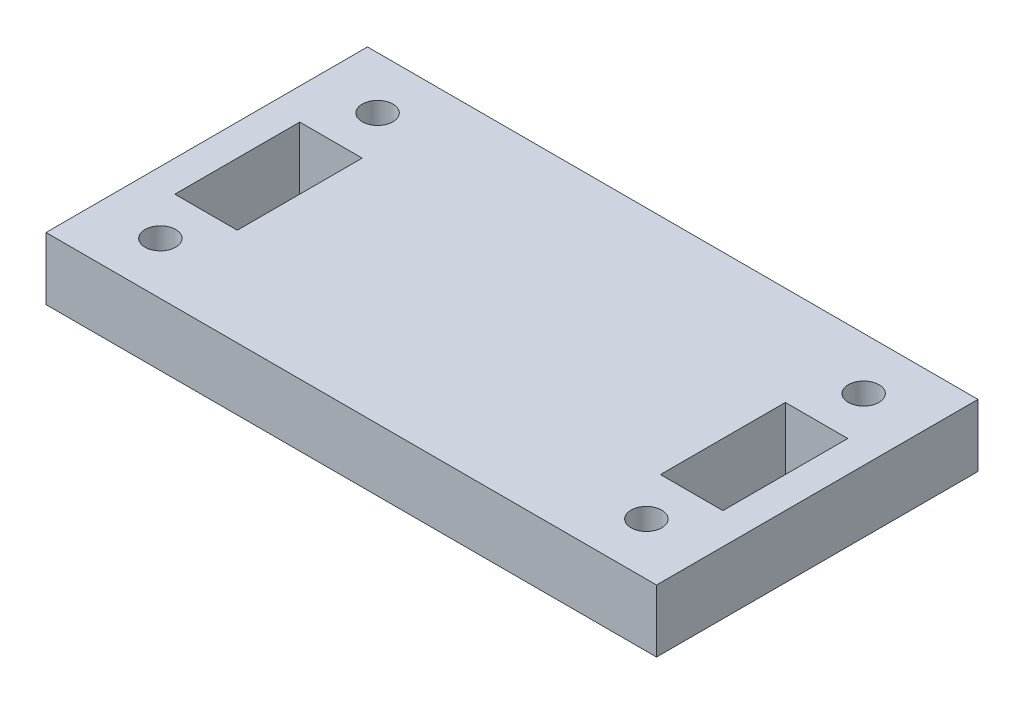
ISO-10303-21;
HEADER;
FILE_DESCRIPTION(('STEP AP214'),'2;1');
FILE_NAME('part.step','',(''),(''),'','','');
FILE_SCHEMA(('AUTOMOTIVE_DESIGN { 1 0 10303 214 1 1 1 1 }'));
ENDSEC;
DATA;
#1=APPLICATION_CONTEXT('core data for automotive mechanical design processes');
#2=APPLICATION_PROTOCOL_DEFINITION('international standard','automotive_design',2000,#1);
#3=PRODUCT_CONTEXT('',#1,'mechanical');
#4=PRODUCT('Part','Part','',(#3));
#5=PRODUCT_RELATED_PRODUCT_CATEGORY('part','',(#4));
#6=PRODUCT_DEFINITION_FORMATION('','',#4);
#7=PRODUCT_DEFINITION_CONTEXT('part definition',#1,'design');
#8=PRODUCT_DEFINITION('design','',#6,#7);
#9=PRODUCT_DEFINITION_SHAPE('','',#8);
#10=(LENGTH_UNIT() NAMED_UNIT(*) SI_UNIT(.MILLI.,.METRE.));
#11=(NAMED_UNIT(*) PLANE_ANGLE_UNIT() SI_UNIT($,.RADIAN.));
#12=(NAMED_UNIT(*) SI_UNIT($,.STERADIAN.) SOLID_ANGLE_UNIT());
#13=UNCERTAINTY_MEASURE_WITH_UNIT(LENGTH_MEASURE(1.E-05),#10,'distance_accuracy_value','');
#14=(GEOMETRIC_REPRESENTATION_CONTEXT(3) GLOBAL_UNCERTAINTY_ASSIGNED_CONTEXT((#13)) GLOBAL_UNIT_ASSIGNED_CONTEXT((#10,
#11,#12)) REPRESENTATION_CONTEXT('',''));
#15=CARTESIAN_POINT('',(0.,0.,0.));
#16=DIRECTION('',(0.,0.,1.));
#17=DIRECTION('',(1.,0.,0.));
#18=AXIS2_PLACEMENT_3D('',#15,#16,#17);
#19=CARTESIAN_POINT('',(31.0388,6.35,16.3436479865828));
#20=DIRECTION('',(0.,1.,0.));
#21=DIRECTION('',(0.,0.,1.));
#22=AXIS2_PLACEMENT_3D('',#19,#20,#21);
#23=PLANE('',#22);
#24=DIRECTION('',(1.,0.,0.));
#25=VECTOR('',#24,1.);
#26=CARTESIAN_POINT('',(21.5138,6.35,6.41844327127416));
#27=LINE('',#26,#25);
#28=CARTESIAN_POINT('',(21.5138,6.35,6.41844327127416));
#29=VERTEX_POINT('',#28);
#30=CARTESIAN_POINT('',(27.8638,6.35,6.41844327127416));
#31=VERTEX_POINT('',#30);
#32=EDGE_CURVE('E130',#29,#31,#27,.T.);
#33=ORIENTED_EDGE('',*,*,#32,.F.);
#34=DIRECTION('',(0.,0.,1.));
#35=VECTOR('',#34,1.);
#36=CARTESIAN_POINT('',(21.5138,6.35,-6.28155672872584));
#37=LINE('',#36,#35);
#38=CARTESIAN_POINT('',(21.5138,6.35,-6.28155672872584));
#39=VERTEX_POINT('',#38);
#40=EDGE_CURVE('E122',#39,#29,#37,.T.);
#41=ORIENTED_EDGE('',*,*,#40,.F.);
#42=DIRECTION('',(-1.,0.,0.));
#43=VECTOR('',#42,1.);
#44=CARTESIAN_POINT('',(21.5138,6.35,-6.28155672872584));
#45=LINE('',#44,#43);
#46=CARTESIAN_POINT('',(27.8638,6.35,-6.28155672872584));
#47=VERTEX_POINT('',#46);
#48=EDGE_CURVE('E145',#47,#39,#45,.T.);
#49=ORIENTED_EDGE('',*,*,#48,.F.);
#50=DIRECTION('',(0.,0.,-1.));
#51=VECTOR('',#50,1.);
#52=CARTESIAN_POINT('',(27.8638,6.35,-6.28155672872584));
#53=LINE('',#52,#51);
#54=EDGE_CURVE('E143',#31,#47,#53,.T.);
#55=ORIENTED_EDGE('',*,*,#54,.F.);
#56=EDGE_LOOP('',(#33,#41,#49,#55));
#57=FACE_BOUND('',#56,.T.);
#58=CARTESIAN_POINT('',(-24.7096471512574,6.35,11.0440567287259));
#59=DIRECTION('',(0.,1.,0.));
#60=DIRECTION('',(0.,0.,-1.));
#61=AXIS2_PLACEMENT_3D('',#58,#59,#60);
#62=CIRCLE('',#61,1.5621);
#63=CARTESIAN_POINT('',(-24.7096471512574,6.35,9.48195672872585));
#64=VERTEX_POINT('',#63);
#65=EDGE_CURVE('E167',#64,#64,#62,.T.);
#66=ORIENTED_EDGE('',*,*,#65,.F.);
#67=EDGE_LOOP('',(#66));
#68=FACE_BOUND('',#67,.T.);
#69=DIRECTION('',(-1.,0.,0.));
#70=VECTOR('',#69,1.);
#71=CARTESIAN_POINT('',(-21.5138,6.35,-6.28155672872584));
#72=LINE('',#71,#70);
#73=CARTESIAN_POINT('',(-21.5138,6.35,-6.28155672872584));
#74=VERTEX_POINT('',#73);
#75=CARTESIAN_POINT('',(-27.8638,6.35,-6.28155672872584));
#76=VERTEX_POINT('',#75);
#77=EDGE_CURVE('E181',#74,#76,#72,.T.);
#78=ORIENTED_EDGE('',*,*,#77,.F.);
#79=DIRECTION('',(0.,0.,-1.));
#80=VECTOR('',#79,1.);
#81=CARTESIAN_POINT('',(-21.5138,6.35,-6.28155672872584));
#82=LINE('',#81,#80);
#83=CARTESIAN_POINT('',(-21.5138,6.35,6.41844327127416));
#84=VERTEX_POINT('',#83);
#85=EDGE_CURVE('E179',#84,#74,#82,.T.);
#86=ORIENTED_EDGE('',*,*,#85,.F.);
#87=DIRECTION('',(1.,0.,0.));
#88=VECTOR('',#87,1.);
#89=CARTESIAN_POINT('',(-21.5138,6.35,6.41844327127416));
#90=LINE('',#89,#88);
#91=CARTESIAN_POINT('',(-27.8638,6.35,6.41844327127416));
#92=VERTEX_POINT('',#91);
#93=EDGE_CURVE('E187',#92,#84,#90,.T.);
#94=ORIENTED_EDGE('',*,*,#93,.F.);
#95=DIRECTION('',(0.,0.,1.));
#96=VECTOR('',#95,1.);
#97=CARTESIAN_POINT('',(-27.8638,6.35,-6.28155672872584));
#98=LINE('',#97,#96);
#99=EDGE_CURVE('E184',#76,#92,#98,.T.);
#100=ORIENTED_EDGE('',*,*,#99,.F.);
#101=EDGE_LOOP('',(#78,#86,#94,#100));
#102=FACE_BOUND('',#101,.T.);
#103=DIRECTION('',(1.,0.,0.));
#104=VECTOR('',#103,1.);
#105=CARTESIAN_POINT('',(29.68469832055,6.35,16.3436479865828));
#106=LINE('',#105,#104);
#107=CARTESIAN_POINT('',(-31.0388,6.35,16.3436479865828));
#108=VERTEX_POINT('',#107);
#109=CARTESIAN_POINT('',(31.0388,6.35,16.3436479865828));
#110=VERTEX_POINT('',#109);
#111=EDGE_CURVE('E210',#108,#110,#106,.T.);
#112=ORIENTED_EDGE('',*,*,#111,.T.);
#113=DIRECTION('',(0.,0.,-1.));
#114=VECTOR('',#113,1.);
#115=CARTESIAN_POINT('',(31.0388,6.35,16.3436479865828));
#116=LINE('',#115,#114);
#117=CARTESIAN_POINT('',(31.0388,6.35,-16.3436479865828));
#118=VERTEX_POINT('',#117);
#119=EDGE_CURVE('E213',#110,#118,#116,.T.);
#120=ORIENTED_EDGE('',*,*,#119,.T.);
#121=DIRECTION('',(-1.,0.,0.));
#122=VECTOR('',#121,1.);
#123=CARTESIAN_POINT('',(31.0388,6.35,-16.3436479865828));
#124=LINE('',#123,#122);
#125=CARTESIAN_POINT('',(-31.0388,6.35,-16.3436479865828));
#126=VERTEX_POINT('',#125);
#127=EDGE_CURVE('E216',#118,#126,#124,.T.);
#128=ORIENTED_EDGE('',*,*,#127,.T.);
#129=DIRECTION('',(0.,0.,1.));
#130=VECTOR('',#129,1.);
#131=CARTESIAN_POINT('',(-31.0388,6.35,16.3436479865828));
#132=LINE('',#131,#130);
#133=EDGE_CURVE('E218',#126,#108,#132,.T.);
#134=ORIENTED_EDGE('',*,*,#133,.T.);
#135=EDGE_LOOP('',(#112,#120,#128,#134));
#136=FACE_BOUND('',#135,.T.);
#137=CARTESIAN_POINT('',(-24.7096471512574,6.35,-11.0440567287258));
#138=DIRECTION('',(0.,1.,0.));
#139=DIRECTION('',(0.,0.,1.));
#140=AXIS2_PLACEMENT_3D('',#137,#138,#139);
#141=CIRCLE('',#140,1.5621);
#142=CARTESIAN_POINT('',(-24.7096471512574,6.35,-9.48195672872584));
#143=VERTEX_POINT('',#142);
#144=EDGE_CURVE('E173',#143,#143,#141,.T.);
#145=ORIENTED_EDGE('',*,*,#144,.F.);
#146=EDGE_LOOP('',(#145));
#147=FACE_BOUND('',#146,.T.);
#148=CARTESIAN_POINT('',(24.7096471512574,6.35,-11.0440567287258));
#149=DIRECTION('',(0.,1.,0.));
#150=DIRECTION('',(0.,0.,-1.));
#151=AXIS2_PLACEMENT_3D('',#148,#149,#150);
#152=CIRCLE('',#151,1.5621);
#153=CARTESIAN_POINT('',(24.7096471512574,6.35,-12.6061567287258));
#154=VERTEX_POINT('',#153);
#155=EDGE_CURVE('E161',#154,#154,#152,.T.);
#156=ORIENTED_EDGE('',*,*,#155,.F.);
#157=EDGE_LOOP('',(#156));
#158=FACE_BOUND('',#157,.T.);
#159=CARTESIAN_POINT('',(24.7096471512574,6.35,11.0440567287259));
#160=DIRECTION('',(0.,1.,0.));
#161=DIRECTION('',(0.,0.,1.));
#162=AXIS2_PLACEMENT_3D('',#159,#160,#161);
#163=CIRCLE('',#162,1.5621);
#164=CARTESIAN_POINT('',(24.7096471512574,6.35,12.6061567287259));
#165=VERTEX_POINT('',#164);
#166=EDGE_CURVE('E151',#165,#165,#163,.T.);
#167=ORIENTED_EDGE('',*,*,#166,.F.);
#168=EDGE_LOOP('',(#167));
#169=FACE_BOUND('',#168,.T.);
#170=ADVANCED_FACE('F33',(#57,#68,#102,#136,#147,#158,#169),#23,.T.);
#171=CARTESIAN_POINT('',(31.0388,0.,16.3436479865828));
#172=DIRECTION('',(0.,1.,0.));
#173=DIRECTION('',(0.,0.,1.));
#174=AXIS2_PLACEMENT_3D('',#171,#172,#173);
#175=PLANE('',#174);
#176=DIRECTION('',(0.,0.,1.));
#177=VECTOR('',#176,1.);
#178=CARTESIAN_POINT('',(21.5138,0.,-6.28155672872584));
#179=LINE('',#178,#177);
#180=CARTESIAN_POINT('',(21.5138,0.,-6.28155672872584));
#181=VERTEX_POINT('',#180);
#182=CARTESIAN_POINT('',(21.5138,0.,6.41844327127416));
#183=VERTEX_POINT('',#182);
#184=EDGE_CURVE('E56',#181,#183,#179,.T.);
#185=ORIENTED_EDGE('',*,*,#184,.T.);
#186=DIRECTION('',(1.,0.,0.));
#187=VECTOR('',#186,1.);
#188=CARTESIAN_POINT('',(21.5138,0.,6.41844327127416));
#189=LINE('',#188,#187);
#190=CARTESIAN_POINT('',(27.8638,0.,6.41844327127416));
#191=VERTEX_POINT('',#190);
#192=EDGE_CURVE('E137',#183,#191,#189,.T.);
#193=ORIENTED_EDGE('',*,*,#192,.T.);
#194=DIRECTION('',(0.,0.,-1.));
#195=VECTOR('',#194,1.);
#196=CARTESIAN_POINT('',(27.8638,0.,-6.28155672872584));
#197=LINE('',#196,#195);
#198=CARTESIAN_POINT('',(27.8638,0.,-6.28155672872584));
#199=VERTEX_POINT('',#198);
#200=EDGE_CURVE('E153',#191,#199,#197,.T.);
#201=ORIENTED_EDGE('',*,*,#200,.T.);
#202=DIRECTION('',(-1.,0.,0.));
#203=VECTOR('',#202,1.);
#204=CARTESIAN_POINT('',(21.5138,0.,-6.28155672872584));
#205=LINE('',#204,#203);
#206=EDGE_CURVE('E131',#199,#181,#205,.T.);
#207=ORIENTED_EDGE('',*,*,#206,.T.);
#208=EDGE_LOOP('',(#185,#193,#201,#207));
#209=FACE_BOUND('',#208,.T.);
#210=CARTESIAN_POINT('',(-24.7096471512574,0.,11.0440567287259));
#211=DIRECTION('',(0.,1.,0.));
#212=DIRECTION('',(0.,0.,-1.));
#213=AXIS2_PLACEMENT_3D('',#210,#211,#212);
#214=CIRCLE('',#213,1.5621);
#215=CARTESIAN_POINT('',(-24.7096471512574,0.,9.48195672872585));
#216=VERTEX_POINT('',#215);
#217=EDGE_CURVE('E164',#216,#216,#214,.T.);
#218=ORIENTED_EDGE('',*,*,#217,.T.);
#219=EDGE_LOOP('',(#218));
#220=FACE_BOUND('',#219,.T.);
#221=DIRECTION('',(0.,0.,-1.));
#222=VECTOR('',#221,1.);
#223=CARTESIAN_POINT('',(-21.5138,0.,-6.28155672872584));
#224=LINE('',#223,#222);
#225=CARTESIAN_POINT('',(-21.5138,0.,6.41844327127416));
#226=VERTEX_POINT('',#225);
#227=CARTESIAN_POINT('',(-21.5138,0.,-6.28155672872584));
#228=VERTEX_POINT('',#227);
#229=EDGE_CURVE('E176',#226,#228,#224,.T.);
#230=ORIENTED_EDGE('',*,*,#229,.T.);
#231=DIRECTION('',(-1.,0.,0.));
#232=VECTOR('',#231,1.);
#233=CARTESIAN_POINT('',(-21.5138,0.,-6.28155672872584));
#234=LINE('',#233,#232);
#235=CARTESIAN_POINT('',(-27.8638,0.,-6.28155672872584));
#236=VERTEX_POINT('',#235);
#237=EDGE_CURVE('E192',#228,#236,#234,.T.);
#238=ORIENTED_EDGE('',*,*,#237,.T.);
#239=DIRECTION('',(0.,0.,1.));
#240=VECTOR('',#239,1.);
#241=CARTESIAN_POINT('',(-27.8638,0.,-6.28155672872584));
#242=LINE('',#241,#240);
#243=CARTESIAN_POINT('',(-27.8638,0.,6.41844327127416));
#244=VERTEX_POINT('',#243);
#245=EDGE_CURVE('E195',#236,#244,#242,.T.);
#246=ORIENTED_EDGE('',*,*,#245,.T.);
#247=DIRECTION('',(1.,0.,0.));
#248=VECTOR('',#247,1.);
#249=CARTESIAN_POINT('',(-21.5138,0.,6.41844327127416));
#250=LINE('',#249,#248);
#251=EDGE_CURVE('E182',#244,#226,#250,.T.);
#252=ORIENTED_EDGE('',*,*,#251,.T.);
#253=EDGE_LOOP('',(#230,#238,#246,#252));
#254=FACE_BOUND('',#253,.T.);
#255=DIRECTION('',(0.,0.,-1.));
#256=VECTOR('',#255,1.);
#257=CARTESIAN_POINT('',(31.0388,0.,16.3436479865828));
#258=LINE('',#257,#256);
#259=CARTESIAN_POINT('',(31.0388,0.,16.3436479865828));
#260=VERTEX_POINT('',#259);
#261=CARTESIAN_POINT('',(31.0388,0.,-16.3436479865828));
#262=VERTEX_POINT('',#261);
#263=EDGE_CURVE('E209',#260,#262,#258,.T.);
#264=ORIENTED_EDGE('',*,*,#263,.F.);
#265=DIRECTION('',(1.,0.,0.));
#266=VECTOR('',#265,1.);
#267=CARTESIAN_POINT('',(-29.68469832055,0.,16.3436479865828));
#268=LINE('',#267,#266);
#269=CARTESIAN_POINT('',(-31.0388,0.,16.3436479865828));
#270=VERTEX_POINT('',#269);
#271=EDGE_CURVE('E214',#270,#260,#268,.T.);
#272=ORIENTED_EDGE('',*,*,#271,.F.);
#273=DIRECTION('',(0.,0.,1.));
#274=VECTOR('',#273,1.);
#275=CARTESIAN_POINT('',(-31.0388,0.,16.3436479865828));
#276=LINE('',#275,#274);
#277=CARTESIAN_POINT('',(-31.0388,0.,-16.3436479865828));
#278=VERTEX_POINT('',#277);
#279=EDGE_CURVE('E226',#278,#270,#276,.T.);
#280=ORIENTED_EDGE('',*,*,#279,.F.);
#281=DIRECTION('',(-1.,0.,0.));
#282=VECTOR('',#281,1.);
#283=CARTESIAN_POINT('',(-31.0388,0.,-16.3436479865828));
#284=LINE('',#283,#282);
#285=EDGE_CURVE('E224',#262,#278,#284,.T.);
#286=ORIENTED_EDGE('',*,*,#285,.F.);
#287=EDGE_LOOP('',(#264,#272,#280,#286));
#288=FACE_BOUND('',#287,.T.);
#289=CARTESIAN_POINT('',(-24.7096471512574,0.,-11.0440567287258));
#290=DIRECTION('',(0.,1.,0.));
#291=DIRECTION('',(0.,0.,1.));
#292=AXIS2_PLACEMENT_3D('',#289,#290,#291);
#293=CIRCLE('',#292,1.5621);
#294=CARTESIAN_POINT('',(-24.7096471512574,0.,-9.48195672872584));
#295=VERTEX_POINT('',#294);
#296=EDGE_CURVE('E170',#295,#295,#293,.T.);
#297=ORIENTED_EDGE('',*,*,#296,.T.);
#298=EDGE_LOOP('',(#297));
#299=FACE_BOUND('',#298,.T.);
#300=CARTESIAN_POINT('',(24.7096471512574,0.,-11.0440567287258));
#301=DIRECTION('',(0.,1.,0.));
#302=DIRECTION('',(0.,0.,-1.));
#303=AXIS2_PLACEMENT_3D('',#300,#301,#302);
#304=CIRCLE('',#303,1.5621);
#305=CARTESIAN_POINT('',(24.7096471512574,0.,-12.6061567287258));
#306=VERTEX_POINT('',#305);
#307=EDGE_CURVE('E138',#306,#306,#304,.T.);
#308=ORIENTED_EDGE('',*,*,#307,.T.);
#309=EDGE_LOOP('',(#308));
#310=FACE_BOUND('',#309,.T.);
#311=CARTESIAN_POINT('',(24.7096471512574,0.,11.0440567287259));
#312=DIRECTION('',(0.,1.,0.));
#313=DIRECTION('',(0.,0.,1.));
#314=AXIS2_PLACEMENT_3D('',#311,#312,#313);
#315=CIRCLE('',#314,1.5621);
#316=CARTESIAN_POINT('',(24.7096471512574,0.,12.6061567287259));
#317=VERTEX_POINT('',#316);
#318=EDGE_CURVE('E264',#317,#317,#315,.T.);
#319=ORIENTED_EDGE('',*,*,#318,.T.);
#320=EDGE_LOOP('',(#319));
#321=FACE_BOUND('',#320,.T.);
#322=ADVANCED_FACE('F244',(#209,#220,#254,#288,#299,#310,#321),#175,.F.);
#323=CARTESIAN_POINT('',(31.0388,6.35,16.3436479865828));
#324=DIRECTION('',(-1.,0.,0.));
#325=DIRECTION('',(0.,0.,1.));
#326=AXIS2_PLACEMENT_3D('',#323,#324,#325);
#327=PLANE('',#326);
#328=ORIENTED_EDGE('',*,*,#263,.T.);
#329=DIRECTION('',(0.,-1.,0.));
#330=VECTOR('',#329,1.);
#331=CARTESIAN_POINT('',(31.0388,6.35,-16.3436479865828));
#332=LINE('',#331,#330);
#333=EDGE_CURVE('E41',#118,#262,#332,.T.);
#334=ORIENTED_EDGE('',*,*,#333,.F.);
#335=ORIENTED_EDGE('',*,*,#119,.F.);
#336=DIRECTION('',(0.,-1.,0.));
#337=VECTOR('',#336,1.);
#338=CARTESIAN_POINT('',(31.0388,6.35,16.3436479865828));
#339=LINE('',#338,#337);
#340=EDGE_CURVE('E11',#110,#260,#339,.T.);
#341=ORIENTED_EDGE('',*,*,#340,.T.);
#342=EDGE_LOOP('',(#328,#334,#335,#341));
#343=FACE_BOUND('',#342,.T.);
#344=ADVANCED_FACE('F35',(#343),#327,.F.);
#345=CARTESIAN_POINT('',(-31.0388,6.35,-16.3436479865828));
#346=DIRECTION('',(0.,0.,1.));
#347=DIRECTION('',(1.,0.,0.));
#348=AXIS2_PLACEMENT_3D('',#345,#346,#347);
#349=PLANE('',#348);
#350=ORIENTED_EDGE('',*,*,#285,.T.);
#351=DIRECTION('',(0.,-1.,0.));
#352=VECTOR('',#351,1.);
#353=CARTESIAN_POINT('',(-31.0388,6.35,-16.3436479865828));
#354=LINE('',#353,#352);
#355=EDGE_CURVE('E232',#126,#278,#354,.T.);
#356=ORIENTED_EDGE('',*,*,#355,.F.);
#357=ORIENTED_EDGE('',*,*,#127,.F.);
#358=ORIENTED_EDGE('',*,*,#333,.T.);
#359=EDGE_LOOP('',(#350,#356,#357,#358));
#360=FACE_BOUND('',#359,.T.);
#361=ADVANCED_FACE('F238',(#360),#349,.F.);
#362=CARTESIAN_POINT('',(-31.0388,6.35,16.3436479865828));
#363=DIRECTION('',(1.,0.,0.));
#364=DIRECTION('',(0.,0.,-1.));
#365=AXIS2_PLACEMENT_3D('',#362,#363,#364);
#366=PLANE('',#365);
#367=ORIENTED_EDGE('',*,*,#279,.T.);
#368=DIRECTION('',(0.,-1.,0.));
#369=VECTOR('',#368,1.);
#370=CARTESIAN_POINT('',(-31.0388,6.35,16.3436479865828));
#371=LINE('',#370,#369);
#372=EDGE_CURVE('E221',#108,#270,#371,.T.);
#373=ORIENTED_EDGE('',*,*,#372,.F.);
#374=ORIENTED_EDGE('',*,*,#133,.F.);
#375=ORIENTED_EDGE('',*,*,#355,.T.);
#376=EDGE_LOOP('',(#367,#373,#374,#375));
#377=FACE_BOUND('',#376,.T.);
#378=ADVANCED_FACE('F249',(#377),#366,.F.);
#379=CARTESIAN_POINT('',(-29.68469832055,6.35,16.3436479865828));
#380=DIRECTION('',(0.,0.,-1.));
#381=DIRECTION('',(-1.,0.,0.));
#382=AXIS2_PLACEMENT_3D('',#379,#380,#381);
#383=PLANE('',#382);
#384=ORIENTED_EDGE('',*,*,#271,.T.);
#385=ORIENTED_EDGE('',*,*,#340,.F.);
#386=ORIENTED_EDGE('',*,*,#111,.F.);
#387=ORIENTED_EDGE('',*,*,#372,.T.);
#388=EDGE_LOOP('',(#384,#385,#386,#387));
#389=FACE_BOUND('',#388,.T.);
#390=ADVANCED_FACE('F252',(#389),#383,.F.);
#391=CARTESIAN_POINT('',(-21.5138,6.35,-6.28155672872584));
#392=DIRECTION('',(-1.,0.,0.));
#393=DIRECTION('',(0.,0.,1.));
#394=AXIS2_PLACEMENT_3D('',#391,#392,#393);
#395=PLANE('',#394);
#396=ORIENTED_EDGE('',*,*,#229,.F.);
#397=DIRECTION('',(0.,-1.,0.));
#398=VECTOR('',#397,1.);
#399=CARTESIAN_POINT('',(-21.5138,6.35,6.41844327127416));
#400=LINE('',#399,#398);
#401=EDGE_CURVE('E189',#84,#226,#400,.T.);
#402=ORIENTED_EDGE('',*,*,#401,.F.);
#403=ORIENTED_EDGE('',*,*,#85,.T.);
#404=DIRECTION('',(0.,-1.,0.));
#405=VECTOR('',#404,1.);
#406=CARTESIAN_POINT('',(-21.5138,6.35,-6.28155672872584));
#407=LINE('',#406,#405);
#408=EDGE_CURVE('E206',#74,#228,#407,.T.);
#409=ORIENTED_EDGE('',*,*,#408,.T.);
#410=EDGE_LOOP('',(#396,#402,#403,#409));
#411=FACE_BOUND('',#410,.T.);
#412=ADVANCED_FACE('F310',(#411),#395,.T.);
#413=CARTESIAN_POINT('',(-21.5138,6.35,-6.28155672872584));
#414=DIRECTION('',(0.,0.,1.));
#415=DIRECTION('',(1.,0.,0.));
#416=AXIS2_PLACEMENT_3D('',#413,#414,#415);
#417=PLANE('',#416);
#418=ORIENTED_EDGE('',*,*,#237,.F.);
#419=ORIENTED_EDGE('',*,*,#408,.F.);
#420=ORIENTED_EDGE('',*,*,#77,.T.);
#421=DIRECTION('',(0.,-1.,0.));
#422=VECTOR('',#421,1.);
#423=CARTESIAN_POINT('',(-27.8638,6.35,-6.28155672872584));
#424=LINE('',#423,#422);
#425=EDGE_CURVE('E204',#76,#236,#424,.T.);
#426=ORIENTED_EDGE('',*,*,#425,.T.);
#427=EDGE_LOOP('',(#418,#419,#420,#426));
#428=FACE_BOUND('',#427,.T.);
#429=ADVANCED_FACE('F306',(#428),#417,.T.);
#430=CARTESIAN_POINT('',(-27.8638,6.35,-6.28155672872584));
#431=DIRECTION('',(1.,0.,0.));
#432=DIRECTION('',(0.,0.,-1.));
#433=AXIS2_PLACEMENT_3D('',#430,#431,#432);
#434=PLANE('',#433);
#435=ORIENTED_EDGE('',*,*,#245,.F.);
#436=ORIENTED_EDGE('',*,*,#425,.F.);
#437=ORIENTED_EDGE('',*,*,#99,.T.);
#438=DIRECTION('',(0.,-1.,0.));
#439=VECTOR('',#438,1.);
#440=CARTESIAN_POINT('',(-27.8638,6.35,6.41844327127416));
#441=LINE('',#440,#439);
#442=EDGE_CURVE('E202',#92,#244,#441,.T.);
#443=ORIENTED_EDGE('',*,*,#442,.T.);
#444=EDGE_LOOP('',(#435,#436,#437,#443));
#445=FACE_BOUND('',#444,.T.);
#446=ADVANCED_FACE('F302',(#445),#434,.T.);
#447=CARTESIAN_POINT('',(-21.5138,6.35,6.41844327127416));
#448=DIRECTION('',(0.,0.,-1.));
#449=DIRECTION('',(-1.,0.,0.));
#450=AXIS2_PLACEMENT_3D('',#447,#448,#449);
#451=PLANE('',#450);
#452=ORIENTED_EDGE('',*,*,#251,.F.);
#453=ORIENTED_EDGE('',*,*,#442,.F.);
#454=ORIENTED_EDGE('',*,*,#93,.T.);
#455=ORIENTED_EDGE('',*,*,#401,.T.);
#456=EDGE_LOOP('',(#452,#453,#454,#455));
#457=FACE_BOUND('',#456,.T.);
#458=ADVANCED_FACE('F298',(#457),#451,.T.);
#459=CARTESIAN_POINT('',(-24.7096471512574,6.35,-11.0440567287258));
#460=DIRECTION('',(0.,-1.,0.));
#461=DIRECTION('',(0.,0.,-1.));
#462=AXIS2_PLACEMENT_3D('',#459,#460,#461);
#463=CYLINDRICAL_SURFACE('',#462,1.5621);
#464=ORIENTED_EDGE('',*,*,#144,.T.);
#465=EDGE_LOOP('',(#464));
#466=FACE_BOUND('',#465,.T.);
#467=ORIENTED_EDGE('',*,*,#296,.F.);
#468=EDGE_LOOP('',(#467));
#469=FACE_BOUND('',#468,.T.);
#470=ADVANCED_FACE('F294',(#466,#469),#463,.F.);
#471=CARTESIAN_POINT('',(-24.7096471512574,6.35,11.0440567287259));
#472=DIRECTION('',(0.,-1.,0.));
#473=DIRECTION('',(0.,0.,-1.));
#474=AXIS2_PLACEMENT_3D('',#471,#472,#473);
#475=CYLINDRICAL_SURFACE('',#474,1.5621);
#476=ORIENTED_EDGE('',*,*,#65,.T.);
#477=EDGE_LOOP('',(#476));
#478=FACE_BOUND('',#477,.T.);
#479=ORIENTED_EDGE('',*,*,#217,.F.);
#480=EDGE_LOOP('',(#479));
#481=FACE_BOUND('',#480,.T.);
#482=ADVANCED_FACE('F290',(#478,#481),#475,.F.);
#483=CARTESIAN_POINT('',(24.7096471512574,6.35,-11.0440567287258));
#484=DIRECTION('',(0.,-1.,0.));
#485=DIRECTION('',(0.,0.,-1.));
#486=AXIS2_PLACEMENT_3D('',#483,#484,#485);
#487=CYLINDRICAL_SURFACE('',#486,1.5621);
#488=ORIENTED_EDGE('',*,*,#155,.T.);
#489=EDGE_LOOP('',(#488));
#490=FACE_BOUND('',#489,.T.);
#491=ORIENTED_EDGE('',*,*,#307,.F.);
#492=EDGE_LOOP('',(#491));
#493=FACE_BOUND('',#492,.T.);
#494=ADVANCED_FACE('F287',(#490,#493),#487,.F.);
#495=CARTESIAN_POINT('',(21.5138,6.35,-6.28155672872584));
#496=DIRECTION('',(1.,0.,0.));
#497=DIRECTION('',(0.,0.,-1.));
#498=AXIS2_PLACEMENT_3D('',#495,#496,#497);
#499=PLANE('',#498);
#500=ORIENTED_EDGE('',*,*,#184,.F.);
#501=DIRECTION('',(0.,-1.,0.));
#502=VECTOR('',#501,1.);
#503=CARTESIAN_POINT('',(21.5138,6.35,-6.28155672872584));
#504=LINE('',#503,#502);
#505=EDGE_CURVE('E126',#39,#181,#504,.T.);
#506=ORIENTED_EDGE('',*,*,#505,.F.);
#507=ORIENTED_EDGE('',*,*,#40,.T.);
#508=DIRECTION('',(0.,-1.,0.));
#509=VECTOR('',#508,1.);
#510=CARTESIAN_POINT('',(21.5138,6.35,6.41844327127416));
#511=LINE('',#510,#509);
#512=EDGE_CURVE('E125',#29,#183,#511,.T.);
#513=ORIENTED_EDGE('',*,*,#512,.T.);
#514=EDGE_LOOP('',(#500,#506,#507,#513));
#515=FACE_BOUND('',#514,.T.);
#516=ADVANCED_FACE('F124',(#515),#499,.T.);
#517=CARTESIAN_POINT('',(21.5138,6.35,6.41844327127416));
#518=DIRECTION('',(0.,0.,-1.));
#519=DIRECTION('',(-1.,0.,0.));
#520=AXIS2_PLACEMENT_3D('',#517,#518,#519);
#521=PLANE('',#520);
#522=ORIENTED_EDGE('',*,*,#192,.F.);
#523=ORIENTED_EDGE('',*,*,#512,.F.);
#524=ORIENTED_EDGE('',*,*,#32,.T.);
#525=DIRECTION('',(0.,-1.,0.));
#526=VECTOR('',#525,1.);
#527=CARTESIAN_POINT('',(27.8638,6.35,6.41844327127416));
#528=LINE('',#527,#526);
#529=EDGE_CURVE('E139',#31,#191,#528,.T.);
#530=ORIENTED_EDGE('',*,*,#529,.T.);
#531=EDGE_LOOP('',(#522,#523,#524,#530));
#532=FACE_BOUND('',#531,.T.);
#533=ADVANCED_FACE('F134',(#532),#521,.T.);
#534=CARTESIAN_POINT('',(27.8638,6.35,-6.28155672872584));
#535=DIRECTION('',(-1.,0.,0.));
#536=DIRECTION('',(0.,0.,1.));
#537=AXIS2_PLACEMENT_3D('',#534,#535,#536);
#538=PLANE('',#537);
#539=ORIENTED_EDGE('',*,*,#200,.F.);
#540=ORIENTED_EDGE('',*,*,#529,.F.);
#541=ORIENTED_EDGE('',*,*,#54,.T.);
#542=DIRECTION('',(0.,-1.,0.));
#543=VECTOR('',#542,1.);
#544=CARTESIAN_POINT('',(27.8638,6.35,-6.28155672872584));
#545=LINE('',#544,#543);
#546=EDGE_CURVE('E48',#47,#199,#545,.T.);
#547=ORIENTED_EDGE('',*,*,#546,.T.);
#548=EDGE_LOOP('',(#539,#540,#541,#547));
#549=FACE_BOUND('',#548,.T.);
#550=ADVANCED_FACE('F277',(#549),#538,.T.);
#551=CARTESIAN_POINT('',(21.5138,6.35,-6.28155672872584));
#552=DIRECTION('',(0.,0.,1.));
#553=DIRECTION('',(1.,0.,0.));
#554=AXIS2_PLACEMENT_3D('',#551,#552,#553);
#555=PLANE('',#554);
#556=ORIENTED_EDGE('',*,*,#206,.F.);
#557=ORIENTED_EDGE('',*,*,#546,.F.);
#558=ORIENTED_EDGE('',*,*,#48,.T.);
#559=ORIENTED_EDGE('',*,*,#505,.T.);
#560=EDGE_LOOP('',(#556,#557,#558,#559));
#561=FACE_BOUND('',#560,.T.);
#562=ADVANCED_FACE('F272',(#561),#555,.T.);
#563=CARTESIAN_POINT('',(24.7096471512574,6.35,11.0440567287259));
#564=DIRECTION('',(0.,-1.,0.));
#565=DIRECTION('',(0.,0.,-1.));
#566=AXIS2_PLACEMENT_3D('',#563,#564,#565);
#567=CYLINDRICAL_SURFACE('',#566,1.5621);
#568=ORIENTED_EDGE('',*,*,#166,.T.);
#569=EDGE_LOOP('',(#568));
#570=FACE_BOUND('',#569,.T.);
#571=ORIENTED_EDGE('',*,*,#318,.F.);
#572=EDGE_LOOP('',(#571));
#573=FACE_BOUND('',#572,.T.);
#574=ADVANCED_FACE('F270',(#570,#573),#567,.F.);
#575=CLOSED_SHELL('',(#170,#322,#344,#361,#378,#390,#412,#429,#446,#458,#470,#482,#494,#516,
#533,#550,#562,#574));
#576=MANIFOLD_SOLID_BREP('B2',#575);
#577=ADVANCED_BREP_SHAPE_REPRESENTATION('',(#18,#576),#14);
#578=SHAPE_DEFINITION_REPRESENTATION(#9,#577);
ENDSEC;
END-ISO-10303-21;
